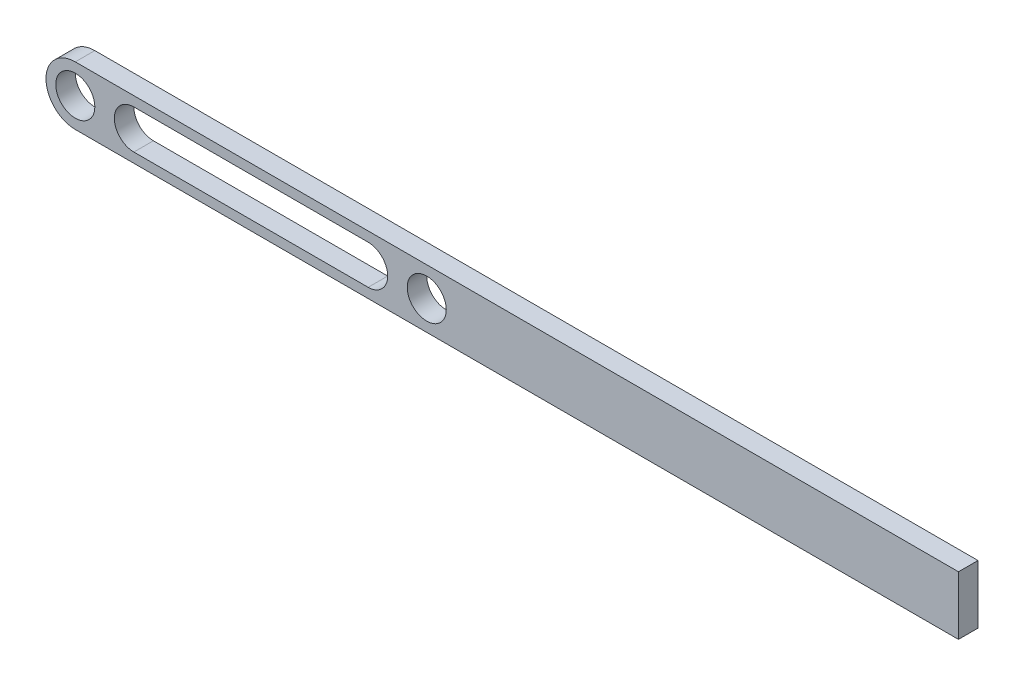
ISO-10303-21;
HEADER;
FILE_DESCRIPTION(('STEP AP214'),'2;1');
FILE_NAME('part.step','',(''),(''),'','','');
FILE_SCHEMA(('AUTOMOTIVE_DESIGN { 1 0 10303 214 1 1 1 1 }'));
ENDSEC;
DATA;
#1=APPLICATION_CONTEXT('core data for automotive mechanical design processes');
#2=APPLICATION_PROTOCOL_DEFINITION('international standard','automotive_design',2000,#1);
#3=PRODUCT_CONTEXT('',#1,'mechanical');
#4=PRODUCT('Part','Part','',(#3));
#5=PRODUCT_RELATED_PRODUCT_CATEGORY('part','',(#4));
#6=PRODUCT_DEFINITION_FORMATION('','',#4);
#7=PRODUCT_DEFINITION_CONTEXT('part definition',#1,'design');
#8=PRODUCT_DEFINITION('design','',#6,#7);
#9=PRODUCT_DEFINITION_SHAPE('','',#8);
#10=(LENGTH_UNIT() NAMED_UNIT(*) SI_UNIT(.MILLI.,.METRE.));
#11=(NAMED_UNIT(*) PLANE_ANGLE_UNIT() SI_UNIT($,.RADIAN.));
#12=(NAMED_UNIT(*) SI_UNIT($,.STERADIAN.) SOLID_ANGLE_UNIT());
#13=UNCERTAINTY_MEASURE_WITH_UNIT(LENGTH_MEASURE(1.E-05),#10,'distance_accuracy_value','');
#14=(GEOMETRIC_REPRESENTATION_CONTEXT(3) GLOBAL_UNCERTAINTY_ASSIGNED_CONTEXT((#13)) GLOBAL_UNIT_ASSIGNED_CONTEXT((#10,
#11,#12)) REPRESENTATION_CONTEXT('',''));
#15=CARTESIAN_POINT('',(0.,0.,0.));
#16=DIRECTION('',(0.,0.,1.));
#17=DIRECTION('',(1.,0.,0.));
#18=AXIS2_PLACEMENT_3D('',#15,#16,#17);
#19=CARTESIAN_POINT('',(0.,0.,10.));
#20=DIRECTION('',(0.,0.,1.));
#21=DIRECTION('',(1.,0.,0.));
#22=AXIS2_PLACEMENT_3D('',#19,#20,#21);
#23=PLANE('',#22);
#24=CARTESIAN_POINT('',(0.,0.,10.));
#25=DIRECTION('',(0.,0.,1.));
#26=DIRECTION('',(1.,0.,0.));
#27=AXIS2_PLACEMENT_3D('',#24,#25,#26);
#28=CIRCLE('',#27,10.);
#29=CARTESIAN_POINT('',(10.,0.,10.));
#30=VERTEX_POINT('',#29);
#31=EDGE_CURVE('E167',#30,#30,#28,.T.);
#32=ORIENTED_EDGE('',*,*,#31,.F.);
#33=EDGE_LOOP('',(#32));
#34=FACE_BOUND('',#33,.T.);
#35=DIRECTION('',(0.,1.,0.));
#36=VECTOR('',#35,1.);
#37=CARTESIAN_POINT('',(452.334951872478,15.,10.));
#38=LINE('',#37,#36);
#39=CARTESIAN_POINT('',(452.334951872478,-15.,10.));
#40=VERTEX_POINT('',#39);
#41=CARTESIAN_POINT('',(452.334951872478,15.,10.));
#42=VERTEX_POINT('',#41);
#43=EDGE_CURVE('E175',#40,#42,#38,.T.);
#44=ORIENTED_EDGE('',*,*,#43,.T.);
#45=DIRECTION('',(-1.,0.,0.));
#46=VECTOR('',#45,1.);
#47=CARTESIAN_POINT('',(180.,15.,10.));
#48=LINE('',#47,#46);
#49=CARTESIAN_POINT('',(0.,15.,10.));
#50=VERTEX_POINT('',#49);
#51=EDGE_CURVE('E179',#42,#50,#48,.T.);
#52=ORIENTED_EDGE('',*,*,#51,.T.);
#53=CARTESIAN_POINT('',(0.,0.,10.));
#54=DIRECTION('',(0.,0.,1.));
#55=DIRECTION('',(1.,0.,0.));
#56=AXIS2_PLACEMENT_3D('',#53,#54,#55);
#57=CIRCLE('',#56,15.);
#58=CARTESIAN_POINT('',(0.,-15.,10.));
#59=VERTEX_POINT('',#58);
#60=EDGE_CURVE('E183',#50,#59,#57,.T.);
#61=ORIENTED_EDGE('',*,*,#60,.T.);
#62=DIRECTION('',(1.,0.,0.));
#63=VECTOR('',#62,1.);
#64=CARTESIAN_POINT('',(0.,-15.,10.));
#65=LINE('',#64,#63);
#66=EDGE_CURVE('E186',#59,#40,#65,.T.);
#67=ORIENTED_EDGE('',*,*,#66,.T.);
#68=EDGE_LOOP('',(#44,#52,#61,#67));
#69=FACE_BOUND('',#68,.T.);
#70=CARTESIAN_POINT('',(180.,0.,10.));
#71=DIRECTION('',(0.,0.,1.));
#72=DIRECTION('',(1.,0.,0.));
#73=AXIS2_PLACEMENT_3D('',#70,#71,#72);
#74=CIRCLE('',#73,10.);
#75=CARTESIAN_POINT('',(190.,0.,10.));
#76=VERTEX_POINT('',#75);
#77=EDGE_CURVE('E159',#76,#76,#74,.T.);
#78=ORIENTED_EDGE('',*,*,#77,.F.);
#79=EDGE_LOOP('',(#78));
#80=FACE_BOUND('',#79,.T.);
#81=DIRECTION('',(1.,0.,0.));
#82=VECTOR('',#81,1.);
#83=CARTESIAN_POINT('',(30.,-10.,10.));
#84=LINE('',#83,#82);
#85=CARTESIAN_POINT('',(30.,-10.,10.));
#86=VERTEX_POINT('',#85);
#87=CARTESIAN_POINT('',(150.,-10.,10.));
#88=VERTEX_POINT('',#87);
#89=EDGE_CURVE('E120',#86,#88,#84,.T.);
#90=ORIENTED_EDGE('',*,*,#89,.F.);
#91=CARTESIAN_POINT('',(30.,0.,10.));
#92=DIRECTION('',(0.,0.,1.));
#93=DIRECTION('',(1.,0.,0.));
#94=AXIS2_PLACEMENT_3D('',#91,#92,#93);
#95=CIRCLE('',#94,10.);
#96=CARTESIAN_POINT('',(30.,10.,10.));
#97=VERTEX_POINT('',#96);
#98=EDGE_CURVE('E111',#97,#86,#95,.T.);
#99=ORIENTED_EDGE('',*,*,#98,.F.);
#100=DIRECTION('',(-1.,0.,0.));
#101=VECTOR('',#100,1.);
#102=CARTESIAN_POINT('',(30.,10.,10.));
#103=LINE('',#102,#101);
#104=CARTESIAN_POINT('',(150.,10.,10.));
#105=VERTEX_POINT('',#104);
#106=EDGE_CURVE('E137',#105,#97,#103,.T.);
#107=ORIENTED_EDGE('',*,*,#106,.F.);
#108=CARTESIAN_POINT('',(150.,0.,10.));
#109=DIRECTION('',(0.,0.,1.));
#110=DIRECTION('',(1.,0.,0.));
#111=AXIS2_PLACEMENT_3D('',#108,#109,#110);
#112=CIRCLE('',#111,10.);
#113=EDGE_CURVE('E133',#88,#105,#112,.T.);
#114=ORIENTED_EDGE('',*,*,#113,.F.);
#115=EDGE_LOOP('',(#90,#99,#107,#114));
#116=FACE_BOUND('',#115,.T.);
#117=ADVANCED_FACE('F45',(#34,#69,#80,#116),#23,.T.);
#118=CARTESIAN_POINT('',(0.,0.,0.));
#119=DIRECTION('',(0.,0.,1.));
#120=DIRECTION('',(1.,0.,0.));
#121=AXIS2_PLACEMENT_3D('',#118,#119,#120);
#122=PLANE('',#121);
#123=CARTESIAN_POINT('',(180.,0.,0.));
#124=DIRECTION('',(0.,0.,1.));
#125=DIRECTION('',(1.,0.,0.));
#126=AXIS2_PLACEMENT_3D('',#123,#124,#125);
#127=CIRCLE('',#126,10.);
#128=CARTESIAN_POINT('',(190.,0.,0.));
#129=VERTEX_POINT('',#128);
#130=EDGE_CURVE('E129',#129,#129,#127,.T.);
#131=ORIENTED_EDGE('',*,*,#130,.T.);
#132=EDGE_LOOP('',(#131));
#133=FACE_BOUND('',#132,.T.);
#134=CARTESIAN_POINT('',(0.,0.,0.));
#135=DIRECTION('',(0.,0.,1.));
#136=DIRECTION('',(1.,0.,0.));
#137=AXIS2_PLACEMENT_3D('',#134,#135,#136);
#138=CIRCLE('',#137,10.);
#139=CARTESIAN_POINT('',(10.,0.,0.));
#140=VERTEX_POINT('',#139);
#141=EDGE_CURVE('E163',#140,#140,#138,.T.);
#142=ORIENTED_EDGE('',*,*,#141,.T.);
#143=EDGE_LOOP('',(#142));
#144=FACE_BOUND('',#143,.T.);
#145=DIRECTION('',(0.,1.,0.));
#146=VECTOR('',#145,1.);
#147=CARTESIAN_POINT('',(452.334951872478,15.,0.));
#148=LINE('',#147,#146);
#149=CARTESIAN_POINT('',(452.334951872478,-15.,0.));
#150=VERTEX_POINT('',#149);
#151=CARTESIAN_POINT('',(452.334951872478,15.,0.));
#152=VERTEX_POINT('',#151);
#153=EDGE_CURVE('E171',#150,#152,#148,.T.);
#154=ORIENTED_EDGE('',*,*,#153,.F.);
#155=DIRECTION('',(1.,0.,0.));
#156=VECTOR('',#155,1.);
#157=CARTESIAN_POINT('',(180.,-15.,0.));
#158=LINE('',#157,#156);
#159=CARTESIAN_POINT('',(0.,-15.,0.));
#160=VERTEX_POINT('',#159);
#161=EDGE_CURVE('E180',#160,#150,#158,.T.);
#162=ORIENTED_EDGE('',*,*,#161,.F.);
#163=CARTESIAN_POINT('',(0.,0.,0.));
#164=DIRECTION('',(0.,0.,1.));
#165=DIRECTION('',(1.,0.,0.));
#166=AXIS2_PLACEMENT_3D('',#163,#164,#165);
#167=CIRCLE('',#166,15.);
#168=CARTESIAN_POINT('',(0.,15.,0.));
#169=VERTEX_POINT('',#168);
#170=EDGE_CURVE('E196',#169,#160,#167,.T.);
#171=ORIENTED_EDGE('',*,*,#170,.F.);
#172=DIRECTION('',(-1.,0.,0.));
#173=VECTOR('',#172,1.);
#174=CARTESIAN_POINT('',(0.,15.,0.));
#175=LINE('',#174,#173);
#176=EDGE_CURVE('E193',#152,#169,#175,.T.);
#177=ORIENTED_EDGE('',*,*,#176,.F.);
#178=EDGE_LOOP('',(#154,#162,#171,#177));
#179=FACE_BOUND('',#178,.T.);
#180=CARTESIAN_POINT('',(30.,0.,0.));
#181=DIRECTION('',(0.,0.,1.));
#182=DIRECTION('',(1.,0.,0.));
#183=AXIS2_PLACEMENT_3D('',#180,#181,#182);
#184=CIRCLE('',#183,10.);
#185=CARTESIAN_POINT('',(30.,9.99999999999999,0.));
#186=VERTEX_POINT('',#185);
#187=CARTESIAN_POINT('',(30.,-10.,0.));
#188=VERTEX_POINT('',#187);
#189=EDGE_CURVE('E69',#186,#188,#184,.T.);
#190=ORIENTED_EDGE('',*,*,#189,.T.);
#191=DIRECTION('',(1.,0.,0.));
#192=VECTOR('',#191,1.);
#193=CARTESIAN_POINT('',(30.,-10.,0.));
#194=LINE('',#193,#192);
#195=CARTESIAN_POINT('',(150.,-10.,0.));
#196=VERTEX_POINT('',#195);
#197=EDGE_CURVE('E127',#188,#196,#194,.T.);
#198=ORIENTED_EDGE('',*,*,#197,.T.);
#199=CARTESIAN_POINT('',(150.,0.,0.));
#200=DIRECTION('',(0.,0.,1.));
#201=DIRECTION('',(1.,0.,0.));
#202=AXIS2_PLACEMENT_3D('',#199,#200,#201);
#203=CIRCLE('',#202,10.);
#204=CARTESIAN_POINT('',(150.,10.,0.));
#205=VERTEX_POINT('',#204);
#206=EDGE_CURVE('E146',#196,#205,#203,.T.);
#207=ORIENTED_EDGE('',*,*,#206,.T.);
#208=DIRECTION('',(-1.,0.,0.));
#209=VECTOR('',#208,1.);
#210=CARTESIAN_POINT('',(30.,10.,0.));
#211=LINE('',#210,#209);
#212=EDGE_CURVE('E121',#205,#186,#211,.T.);
#213=ORIENTED_EDGE('',*,*,#212,.T.);
#214=EDGE_LOOP('',(#190,#198,#207,#213));
#215=FACE_BOUND('',#214,.T.);
#216=ADVANCED_FACE('F219',(#133,#144,#179,#215),#122,.F.);
#217=CARTESIAN_POINT('',(452.334951872478,15.,10.));
#218=DIRECTION('',(-1.,0.,0.));
#219=DIRECTION('',(0.,0.,1.));
#220=AXIS2_PLACEMENT_3D('',#217,#218,#219);
#221=PLANE('',#220);
#222=ORIENTED_EDGE('',*,*,#153,.T.);
#223=DIRECTION('',(0.,0.,-1.));
#224=VECTOR('',#223,1.);
#225=CARTESIAN_POINT('',(452.334951872478,15.,10.));
#226=LINE('',#225,#224);
#227=EDGE_CURVE('E11',#42,#152,#226,.T.);
#228=ORIENTED_EDGE('',*,*,#227,.F.);
#229=ORIENTED_EDGE('',*,*,#43,.F.);
#230=DIRECTION('',(0.,0.,-1.));
#231=VECTOR('',#230,1.);
#232=CARTESIAN_POINT('',(452.334951872478,-15.,10.));
#233=LINE('',#232,#231);
#234=EDGE_CURVE('E189',#40,#150,#233,.T.);
#235=ORIENTED_EDGE('',*,*,#234,.T.);
#236=EDGE_LOOP('',(#222,#228,#229,#235));
#237=FACE_BOUND('',#236,.T.);
#238=ADVANCED_FACE('F47',(#237),#221,.F.);
#239=CARTESIAN_POINT('',(0.,15.,10.));
#240=DIRECTION('',(0.,-1.,0.));
#241=DIRECTION('',(0.,0.,-1.));
#242=AXIS2_PLACEMENT_3D('',#239,#240,#241);
#243=PLANE('',#242);
#244=ORIENTED_EDGE('',*,*,#176,.T.);
#245=DIRECTION('',(0.,0.,-1.));
#246=VECTOR('',#245,1.);
#247=CARTESIAN_POINT('',(0.,15.,10.));
#248=LINE('',#247,#246);
#249=EDGE_CURVE('E54',#50,#169,#248,.T.);
#250=ORIENTED_EDGE('',*,*,#249,.F.);
#251=ORIENTED_EDGE('',*,*,#51,.F.);
#252=ORIENTED_EDGE('',*,*,#227,.T.);
#253=EDGE_LOOP('',(#244,#250,#251,#252));
#254=FACE_BOUND('',#253,.T.);
#255=ADVANCED_FACE('F230',(#254),#243,.F.);
#256=CARTESIAN_POINT('',(0.,0.,10.));
#257=DIRECTION('',(0.,0.,-1.));
#258=DIRECTION('',(-1.,0.,0.));
#259=AXIS2_PLACEMENT_3D('',#256,#257,#258);
#260=CYLINDRICAL_SURFACE('',#259,15.);
#261=ORIENTED_EDGE('',*,*,#170,.T.);
#262=DIRECTION('',(0.,0.,-1.));
#263=VECTOR('',#262,1.);
#264=CARTESIAN_POINT('',(0.,-15.,10.));
#265=LINE('',#264,#263);
#266=EDGE_CURVE('E205',#59,#160,#265,.T.);
#267=ORIENTED_EDGE('',*,*,#266,.F.);
#268=ORIENTED_EDGE('',*,*,#60,.F.);
#269=ORIENTED_EDGE('',*,*,#249,.T.);
#270=EDGE_LOOP('',(#261,#267,#268,#269));
#271=FACE_BOUND('',#270,.T.);
#272=ADVANCED_FACE('F214',(#271),#260,.T.);
#273=CARTESIAN_POINT('',(180.,-15.,10.));
#274=DIRECTION('',(0.,1.,0.));
#275=DIRECTION('',(0.,0.,1.));
#276=AXIS2_PLACEMENT_3D('',#273,#274,#275);
#277=PLANE('',#276);
#278=ORIENTED_EDGE('',*,*,#161,.T.);
#279=ORIENTED_EDGE('',*,*,#234,.F.);
#280=ORIENTED_EDGE('',*,*,#66,.F.);
#281=ORIENTED_EDGE('',*,*,#266,.T.);
#282=EDGE_LOOP('',(#278,#279,#280,#281));
#283=FACE_BOUND('',#282,.T.);
#284=ADVANCED_FACE('F223',(#283),#277,.F.);
#285=CARTESIAN_POINT('',(0.,0.,10.));
#286=DIRECTION('',(0.,0.,-1.));
#287=DIRECTION('',(-1.,0.,0.));
#288=AXIS2_PLACEMENT_3D('',#285,#286,#287);
#289=CYLINDRICAL_SURFACE('',#288,10.);
#290=ORIENTED_EDGE('',*,*,#31,.T.);
#291=EDGE_LOOP('',(#290));
#292=FACE_BOUND('',#291,.T.);
#293=ORIENTED_EDGE('',*,*,#141,.F.);
#294=EDGE_LOOP('',(#293));
#295=FACE_BOUND('',#294,.T.);
#296=ADVANCED_FACE('F247',(#292,#295),#289,.F.);
#297=CARTESIAN_POINT('',(180.,0.,10.));
#298=DIRECTION('',(0.,0.,-1.));
#299=DIRECTION('',(-1.,0.,0.));
#300=AXIS2_PLACEMENT_3D('',#297,#298,#299);
#301=CYLINDRICAL_SURFACE('',#300,10.);
#302=ORIENTED_EDGE('',*,*,#77,.T.);
#303=EDGE_LOOP('',(#302));
#304=FACE_BOUND('',#303,.T.);
#305=ORIENTED_EDGE('',*,*,#130,.F.);
#306=EDGE_LOOP('',(#305));
#307=FACE_BOUND('',#306,.T.);
#308=ADVANCED_FACE('F254',(#304,#307),#301,.F.);
#309=CARTESIAN_POINT('',(30.,0.,10.));
#310=DIRECTION('',(0.,0.,-1.));
#311=DIRECTION('',(-1.,0.,0.));
#312=AXIS2_PLACEMENT_3D('',#309,#310,#311);
#313=CYLINDRICAL_SURFACE('',#312,10.);
#314=ORIENTED_EDGE('',*,*,#189,.F.);
#315=DIRECTION('',(0.,0.,-1.));
#316=VECTOR('',#315,1.);
#317=CARTESIAN_POINT('',(30.,10.,10.));
#318=LINE('',#317,#316);
#319=EDGE_CURVE('E115',#97,#186,#318,.T.);
#320=ORIENTED_EDGE('',*,*,#319,.F.);
#321=ORIENTED_EDGE('',*,*,#98,.T.);
#322=DIRECTION('',(0.,0.,-1.));
#323=VECTOR('',#322,1.);
#324=CARTESIAN_POINT('',(30.,-10.,10.));
#325=LINE('',#324,#323);
#326=EDGE_CURVE('E114',#86,#188,#325,.T.);
#327=ORIENTED_EDGE('',*,*,#326,.T.);
#328=EDGE_LOOP('',(#314,#320,#321,#327));
#329=FACE_BOUND('',#328,.T.);
#330=ADVANCED_FACE('F113',(#329),#313,.F.);
#331=CARTESIAN_POINT('',(30.,-10.,10.));
#332=DIRECTION('',(0.,1.,0.));
#333=DIRECTION('',(-1.,0.,0.));
#334=AXIS2_PLACEMENT_3D('',#331,#332,#333);
#335=PLANE('',#334);
#336=ORIENTED_EDGE('',*,*,#197,.F.);
#337=ORIENTED_EDGE('',*,*,#326,.F.);
#338=ORIENTED_EDGE('',*,*,#89,.T.);
#339=DIRECTION('',(0.,0.,-1.));
#340=VECTOR('',#339,1.);
#341=CARTESIAN_POINT('',(150.,-10.,10.));
#342=LINE('',#341,#340);
#343=EDGE_CURVE('E130',#88,#196,#342,.T.);
#344=ORIENTED_EDGE('',*,*,#343,.T.);
#345=EDGE_LOOP('',(#336,#337,#338,#344));
#346=FACE_BOUND('',#345,.T.);
#347=ADVANCED_FACE('F124',(#346),#335,.T.);
#348=CARTESIAN_POINT('',(150.,0.,10.));
#349=DIRECTION('',(0.,0.,-1.));
#350=DIRECTION('',(-1.,0.,0.));
#351=AXIS2_PLACEMENT_3D('',#348,#349,#350);
#352=CYLINDRICAL_SURFACE('',#351,10.);
#353=ORIENTED_EDGE('',*,*,#206,.F.);
#354=ORIENTED_EDGE('',*,*,#343,.F.);
#355=ORIENTED_EDGE('',*,*,#113,.T.);
#356=DIRECTION('',(0.,0.,-1.));
#357=VECTOR('',#356,1.);
#358=CARTESIAN_POINT('',(150.,10.,10.));
#359=LINE('',#358,#357);
#360=EDGE_CURVE('E61',#105,#205,#359,.T.);
#361=ORIENTED_EDGE('',*,*,#360,.T.);
#362=EDGE_LOOP('',(#353,#354,#355,#361));
#363=FACE_BOUND('',#362,.T.);
#364=ADVANCED_FACE('F271',(#363),#352,.F.);
#365=CARTESIAN_POINT('',(30.,10.,10.));
#366=DIRECTION('',(0.,-1.,0.));
#367=DIRECTION('',(1.,0.,0.));
#368=AXIS2_PLACEMENT_3D('',#365,#366,#367);
#369=PLANE('',#368);
#370=ORIENTED_EDGE('',*,*,#212,.F.);
#371=ORIENTED_EDGE('',*,*,#360,.F.);
#372=ORIENTED_EDGE('',*,*,#106,.T.);
#373=ORIENTED_EDGE('',*,*,#319,.T.);
#374=EDGE_LOOP('',(#370,#371,#372,#373));
#375=FACE_BOUND('',#374,.T.);
#376=ADVANCED_FACE('F274',(#375),#369,.T.);
#377=CLOSED_SHELL('',(#117,#216,#238,#255,#272,#284,#296,#308,#330,#347,#364,#376));
#378=MANIFOLD_SOLID_BREP('B2',#377);
#379=ADVANCED_BREP_SHAPE_REPRESENTATION('',(#18,#378),#14);
#380=SHAPE_DEFINITION_REPRESENTATION(#9,#379);
ENDSEC;
END-ISO-10303-21;
